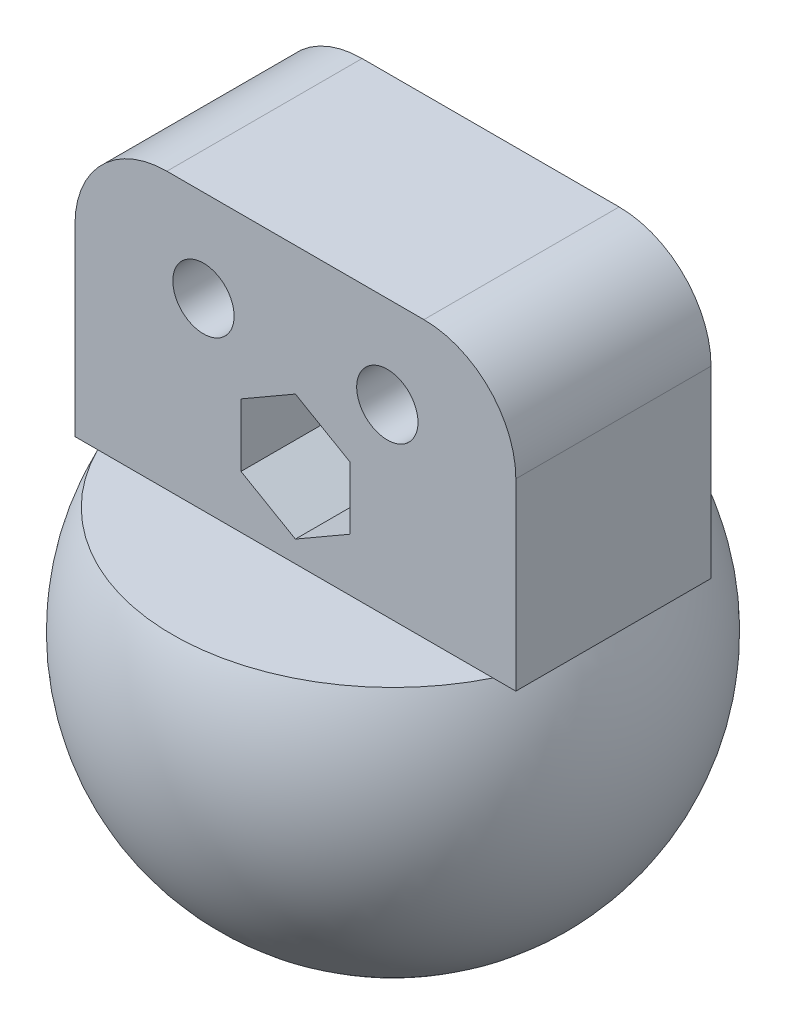
ISO-10303-21;
HEADER;
FILE_DESCRIPTION(('STEP AP214'),'2;1');
FILE_NAME('part.step','',(''),(''),'','','');
FILE_SCHEMA(('AUTOMOTIVE_DESIGN { 1 0 10303 214 1 1 1 1 }'));
ENDSEC;
DATA;
#1=APPLICATION_CONTEXT('core data for automotive mechanical design processes');
#2=APPLICATION_PROTOCOL_DEFINITION('international standard','automotive_design',2000,#1);
#3=PRODUCT_CONTEXT('',#1,'mechanical');
#4=PRODUCT('Part','Part','',(#3));
#5=PRODUCT_RELATED_PRODUCT_CATEGORY('part','',(#4));
#6=PRODUCT_DEFINITION_FORMATION('','',#4);
#7=PRODUCT_DEFINITION_CONTEXT('part definition',#1,'design');
#8=PRODUCT_DEFINITION('design','',#6,#7);
#9=PRODUCT_DEFINITION_SHAPE('','',#8);
#10=(LENGTH_UNIT() NAMED_UNIT(*) SI_UNIT(.MILLI.,.METRE.));
#11=(NAMED_UNIT(*) PLANE_ANGLE_UNIT() SI_UNIT($,.RADIAN.));
#12=(NAMED_UNIT(*) SI_UNIT($,.STERADIAN.) SOLID_ANGLE_UNIT());
#13=UNCERTAINTY_MEASURE_WITH_UNIT(LENGTH_MEASURE(1.E-05),#10,'distance_accuracy_value','');
#14=(GEOMETRIC_REPRESENTATION_CONTEXT(3) GLOBAL_UNCERTAINTY_ASSIGNED_CONTEXT((#13)) GLOBAL_UNIT_ASSIGNED_CONTEXT((#10,
#11,#12)) REPRESENTATION_CONTEXT('',''));
#15=CARTESIAN_POINT('',(0.,0.,0.));
#16=DIRECTION('',(0.,0.,1.));
#17=DIRECTION('',(1.,0.,0.));
#18=AXIS2_PLACEMENT_3D('',#15,#16,#17);
#19=CARTESIAN_POINT('',(0.,0.,0.));
#20=DIRECTION('',(0.,1.,0.));
#21=DIRECTION('',(1.,0.,0.));
#22=AXIS2_PLACEMENT_3D('',#19,#20,#21);
#23=SPHERICAL_SURFACE('',#22,16.);
#24=CARTESIAN_POINT('',(0.,7.,0.));
#25=DIRECTION('',(0.,-1.,0.));
#26=DIRECTION('',(0.,0.,-1.));
#27=AXIS2_PLACEMENT_3D('',#24,#25,#26);
#28=CIRCLE('',#27,14.3874945699382);
#29=CARTESIAN_POINT('',(-12.9005077419457,7.,6.37));
#30=VERTEX_POINT('',#29);
#31=CARTESIAN_POINT('',(-14.3874945699382,7.,0.));
#32=VERTEX_POINT('',#31);
#33=EDGE_CURVE('E352',#30,#32,#28,.T.);
#34=ORIENTED_EDGE('',*,*,#33,.T.);
#35=CARTESIAN_POINT('',(-12.9005077419457,7.,-6.37));
#36=VERTEX_POINT('',#35);
#37=EDGE_CURVE('E238',#32,#36,#28,.T.);
#38=ORIENTED_EDGE('',*,*,#37,.T.);
#39=CARTESIAN_POINT('',(0.,7.,0.));
#40=DIRECTION('',(0.,-1.,0.));
#41=DIRECTION('',(0.,0.,-1.));
#42=AXIS2_PLACEMENT_3D('',#39,#40,#41);
#43=CIRCLE('',#42,14.3874945699382);
#44=CARTESIAN_POINT('',(12.9005077419457,7.,-6.37));
#45=VERTEX_POINT('',#44);
#46=EDGE_CURVE('E271',#45,#36,#43,.F.);
#47=ORIENTED_EDGE('',*,*,#46,.F.);
#48=CARTESIAN_POINT('',(14.3874945699382,7.,0.));
#49=VERTEX_POINT('',#48);
#50=EDGE_CURVE('E237',#45,#49,#28,.T.);
#51=ORIENTED_EDGE('',*,*,#50,.T.);
#52=CARTESIAN_POINT('',(12.9005077419457,7.,6.37));
#53=VERTEX_POINT('',#52);
#54=EDGE_CURVE('E234',#49,#53,#28,.T.);
#55=ORIENTED_EDGE('',*,*,#54,.T.);
#56=CARTESIAN_POINT('',(0.,7.,0.));
#57=DIRECTION('',(0.,1.,0.));
#58=DIRECTION('',(0.,0.,1.));
#59=AXIS2_PLACEMENT_3D('',#56,#57,#58);
#60=CIRCLE('',#59,14.3874945699382);
#61=EDGE_CURVE('E266',#53,#30,#60,.F.);
#62=ORIENTED_EDGE('',*,*,#61,.T.);
#63=EDGE_LOOP('',(#34,#38,#47,#51,#55,#62));
#64=FACE_BOUND('',#63,.T.);
#65=ADVANCED_FACE('F35',(#64),#23,.T.);
#66=CARTESIAN_POINT('',(-14.3874945699382,7.,-6.37));
#67=DIRECTION('',(0.,1.,0.));
#68=DIRECTION('',(0.,0.,-1.));
#69=AXIS2_PLACEMENT_3D('',#66,#67,#68);
#70=PLANE('',#69);
#71=DIRECTION('',(1.,0.,0.));
#72=VECTOR('',#71,1.);
#73=CARTESIAN_POINT('',(-14.3874945699382,7.,-6.37));
#74=LINE('',#73,#72);
#75=CARTESIAN_POINT('',(14.3874945699382,7.,-6.37));
#76=VERTEX_POINT('',#75);
#77=EDGE_CURVE('E208',#45,#76,#74,.T.);
#78=ORIENTED_EDGE('',*,*,#77,.T.);
#79=DIRECTION('',(0.,0.,1.));
#80=VECTOR('',#79,1.);
#81=CARTESIAN_POINT('',(14.3874945699382,7.,-6.37));
#82=LINE('',#81,#80);
#83=EDGE_CURVE('E228',#76,#49,#82,.T.);
#84=ORIENTED_EDGE('',*,*,#83,.T.);
#85=ORIENTED_EDGE('',*,*,#50,.F.);
#86=EDGE_LOOP('',(#78,#84,#85));
#87=FACE_BOUND('',#86,.T.);
#88=ADVANCED_FACE('F293',(#87),#70,.F.);
#89=CARTESIAN_POINT('',(14.3874945699382,7.,6.37));
#90=VERTEX_POINT('',#89);
#91=EDGE_CURVE('E217',#49,#90,#82,.T.);
#92=ORIENTED_EDGE('',*,*,#91,.T.);
#93=DIRECTION('',(1.,0.,0.));
#94=VECTOR('',#93,1.);
#95=CARTESIAN_POINT('',(-14.3874945699382,7.,6.37));
#96=LINE('',#95,#94);
#97=EDGE_CURVE('E219',#53,#90,#96,.T.);
#98=ORIENTED_EDGE('',*,*,#97,.F.);
#99=ORIENTED_EDGE('',*,*,#54,.F.);
#100=EDGE_LOOP('',(#92,#98,#99));
#101=FACE_BOUND('',#100,.T.);
#102=ADVANCED_FACE('F299',(#101),#70,.F.);
#103=CARTESIAN_POINT('',(-14.3874945699382,7.,6.37));
#104=VERTEX_POINT('',#103);
#105=EDGE_CURVE('E220',#104,#30,#96,.T.);
#106=ORIENTED_EDGE('',*,*,#105,.F.);
#107=DIRECTION('',(0.,0.,1.));
#108=VECTOR('',#107,1.);
#109=CARTESIAN_POINT('',(-14.3874945699382,7.,-6.37));
#110=LINE('',#109,#108);
#111=EDGE_CURVE('E231',#32,#104,#110,.T.);
#112=ORIENTED_EDGE('',*,*,#111,.F.);
#113=ORIENTED_EDGE('',*,*,#33,.F.);
#114=EDGE_LOOP('',(#106,#112,#113));
#115=FACE_BOUND('',#114,.T.);
#116=ADVANCED_FACE('F289',(#115),#70,.F.);
#117=CARTESIAN_POINT('',(-3.55,14.5495934556232,-6.37));
#118=DIRECTION('',(1.,0.,0.));
#119=DIRECTION('',(0.,1.,0.));
#120=AXIS2_PLACEMENT_3D('',#117,#118,#119);
#121=PLANE('',#120);
#122=DIRECTION('',(0.,-1.,0.));
#123=VECTOR('',#122,1.);
#124=CARTESIAN_POINT('',(-3.55,14.5495934556232,-6.37));
#125=LINE('',#124,#123);
#126=CARTESIAN_POINT('',(-3.55,14.5495934556232,-6.37));
#127=VERTEX_POINT('',#126);
#128=CARTESIAN_POINT('',(-3.55,10.4504065443768,-6.37));
#129=VERTEX_POINT('',#128);
#130=EDGE_CURVE('E158',#127,#129,#125,.T.);
#131=ORIENTED_EDGE('',*,*,#130,.F.);
#132=DIRECTION('',(0.,0.,1.));
#133=VECTOR('',#132,1.);
#134=CARTESIAN_POINT('',(-3.55,14.5495934556232,-6.37));
#135=LINE('',#134,#133);
#136=CARTESIAN_POINT('',(-3.55,14.5495934556232,6.37));
#137=VERTEX_POINT('',#136);
#138=EDGE_CURVE('E188',#127,#137,#135,.T.);
#139=ORIENTED_EDGE('',*,*,#138,.T.);
#140=DIRECTION('',(0.,-1.,0.));
#141=VECTOR('',#140,1.);
#142=CARTESIAN_POINT('',(-3.55,14.5495934556232,6.37));
#143=LINE('',#142,#141);
#144=CARTESIAN_POINT('',(-3.55,10.4504065443768,6.37));
#145=VERTEX_POINT('',#144);
#146=EDGE_CURVE('E159',#137,#145,#143,.T.);
#147=ORIENTED_EDGE('',*,*,#146,.T.);
#148=DIRECTION('',(0.,0.,-1.));
#149=VECTOR('',#148,1.);
#150=CARTESIAN_POINT('',(-3.55,10.4504065443768,16.));
#151=LINE('',#150,#149);
#152=EDGE_CURVE('E145',#145,#129,#151,.T.);
#153=ORIENTED_EDGE('',*,*,#152,.T.);
#154=EDGE_LOOP('',(#131,#139,#147,#153));
#155=FACE_BOUND('',#154,.T.);
#156=ADVANCED_FACE('F156',(#155),#121,.T.);
#157=CARTESIAN_POINT('',(3.55,10.4504065443768,-6.37));
#158=DIRECTION('',(-1.,0.,0.));
#159=DIRECTION('',(0.,-1.,0.));
#160=AXIS2_PLACEMENT_3D('',#157,#158,#159);
#161=PLANE('',#160);
#162=DIRECTION('',(0.,0.,1.));
#163=VECTOR('',#162,1.);
#164=CARTESIAN_POINT('',(3.55,14.5495934556232,-6.37));
#165=LINE('',#164,#163);
#166=CARTESIAN_POINT('',(3.55,14.5495934556232,-6.37));
#167=VERTEX_POINT('',#166);
#168=CARTESIAN_POINT('',(3.55,14.5495934556232,6.37));
#169=VERTEX_POINT('',#168);
#170=EDGE_CURVE('E170',#167,#169,#165,.T.);
#171=ORIENTED_EDGE('',*,*,#170,.F.);
#172=DIRECTION('',(0.,1.,0.));
#173=VECTOR('',#172,1.);
#174=CARTESIAN_POINT('',(3.55,10.4504065443768,-6.37));
#175=LINE('',#174,#173);
#176=CARTESIAN_POINT('',(3.55,10.4504065443768,-6.37));
#177=VERTEX_POINT('',#176);
#178=EDGE_CURVE('E168',#177,#167,#175,.T.);
#179=ORIENTED_EDGE('',*,*,#178,.F.);
#180=DIRECTION('',(0.,0.,-1.));
#181=VECTOR('',#180,1.);
#182=CARTESIAN_POINT('',(3.55,10.4504065443768,16.));
#183=LINE('',#182,#181);
#184=CARTESIAN_POINT('',(3.55,10.4504065443768,6.37));
#185=VERTEX_POINT('',#184);
#186=EDGE_CURVE('E152',#185,#177,#183,.T.);
#187=ORIENTED_EDGE('',*,*,#186,.F.);
#188=DIRECTION('',(0.,1.,0.));
#189=VECTOR('',#188,1.);
#190=CARTESIAN_POINT('',(3.55,10.4504065443768,6.37));
#191=LINE('',#190,#189);
#192=EDGE_CURVE('E183',#185,#169,#191,.T.);
#193=ORIENTED_EDGE('',*,*,#192,.T.);
#194=EDGE_LOOP('',(#171,#179,#187,#193));
#195=FACE_BOUND('',#194,.T.);
#196=ADVANCED_FACE('F281',(#195),#161,.T.);
#197=CARTESIAN_POINT('',(0.,0.,-6.37));
#198=DIRECTION('',(0.,0.,-1.));
#199=DIRECTION('',(1.,0.,0.));
#200=AXIS2_PLACEMENT_3D('',#197,#198,#199);
#201=PLANE('',#200);
#202=ORIENTED_EDGE('',*,*,#178,.T.);
#203=DIRECTION('',(-0.866025403784439,0.5,0.));
#204=VECTOR('',#203,1.);
#205=CARTESIAN_POINT('',(3.55,14.5495934556232,-6.37));
#206=LINE('',#205,#204);
#207=CARTESIAN_POINT('',(0.,16.5991869112463,-6.37));
#208=VERTEX_POINT('',#207);
#209=EDGE_CURVE('E172',#167,#208,#206,.T.);
#210=ORIENTED_EDGE('',*,*,#209,.T.);
#211=DIRECTION('',(-0.866025403784438,-0.5,0.));
#212=VECTOR('',#211,1.);
#213=CARTESIAN_POINT('',(0.,16.5991869112463,-6.37));
#214=LINE('',#213,#212);
#215=EDGE_CURVE('E166',#208,#127,#214,.T.);
#216=ORIENTED_EDGE('',*,*,#215,.T.);
#217=ORIENTED_EDGE('',*,*,#130,.T.);
#218=DIRECTION('',(0.866025403784439,-0.5,0.));
#219=VECTOR('',#218,1.);
#220=CARTESIAN_POINT('',(3.63765877365274,6.30060981656524,-6.37));
#221=LINE('',#220,#219);
#222=CARTESIAN_POINT('',(0.,8.40081308875366,-6.37));
#223=VERTEX_POINT('',#222);
#224=EDGE_CURVE('E142',#129,#223,#221,.T.);
#225=ORIENTED_EDGE('',*,*,#224,.T.);
#226=DIRECTION('',(0.866025403784438,0.5,0.));
#227=VECTOR('',#226,1.);
#228=CARTESIAN_POINT('',(-3.63765877365274,6.30060981656524,-6.37));
#229=LINE('',#228,#227);
#230=EDGE_CURVE('E151',#223,#177,#229,.T.);
#231=ORIENTED_EDGE('',*,*,#230,.T.);
#232=EDGE_LOOP('',(#202,#210,#216,#217,#225,#231));
#233=FACE_BOUND('',#232,.T.);
#234=DIRECTION('',(-1.,0.,0.));
#235=VECTOR('',#234,1.);
#236=CARTESIAN_POINT('',(-14.3874945699382,25.,-6.37));
#237=LINE('',#236,#235);
#238=CARTESIAN_POINT('',(8.38749456993816,25.,-6.37));
#239=VERTEX_POINT('',#238);
#240=CARTESIAN_POINT('',(-8.38749456993816,25.,-6.37));
#241=VERTEX_POINT('',#240);
#242=EDGE_CURVE('E214',#239,#241,#237,.T.);
#243=ORIENTED_EDGE('',*,*,#242,.F.);
#244=CARTESIAN_POINT('',(8.38749456993816,19.,-6.37));
#245=DIRECTION('',(0.,0.,1.));
#246=DIRECTION('',(1.,0.,0.));
#247=AXIS2_PLACEMENT_3D('',#244,#245,#246);
#248=CIRCLE('',#247,6.);
#249=CARTESIAN_POINT('',(14.3874945699382,19.,-6.37));
#250=VERTEX_POINT('',#249);
#251=EDGE_CURVE('E250',#250,#239,#248,.T.);
#252=ORIENTED_EDGE('',*,*,#251,.F.);
#253=DIRECTION('',(0.,1.,0.));
#254=VECTOR('',#253,1.);
#255=CARTESIAN_POINT('',(14.3874945699382,25.,-6.37));
#256=LINE('',#255,#254);
#257=EDGE_CURVE('E212',#76,#250,#256,.T.);
#258=ORIENTED_EDGE('',*,*,#257,.F.);
#259=ORIENTED_EDGE('',*,*,#77,.F.);
#260=DIRECTION('',(1.,0.,0.));
#261=VECTOR('',#260,1.);
#262=CARTESIAN_POINT('',(-14.3874945699382,7.,-6.37));
#263=LINE('',#262,#261);
#264=EDGE_CURVE('E180',#36,#45,#263,.T.);
#265=ORIENTED_EDGE('',*,*,#264,.F.);
#266=CARTESIAN_POINT('',(-14.3874945699382,7.,-6.37));
#267=VERTEX_POINT('',#266);
#268=EDGE_CURVE('E210',#267,#36,#74,.T.);
#269=ORIENTED_EDGE('',*,*,#268,.F.);
#270=DIRECTION('',(0.,-1.,0.));
#271=VECTOR('',#270,1.);
#272=CARTESIAN_POINT('',(-14.3874945699382,25.,-6.37));
#273=LINE('',#272,#271);
#274=CARTESIAN_POINT('',(-14.3874945699382,19.,-6.37));
#275=VERTEX_POINT('',#274);
#276=EDGE_CURVE('E205',#275,#267,#273,.T.);
#277=ORIENTED_EDGE('',*,*,#276,.F.);
#278=CARTESIAN_POINT('',(-8.38749456993816,19.,-6.37));
#279=DIRECTION('',(0.,0.,1.));
#280=DIRECTION('',(1.,0.,0.));
#281=AXIS2_PLACEMENT_3D('',#278,#279,#280);
#282=CIRCLE('',#281,6.);
#283=EDGE_CURVE('E252',#241,#275,#282,.T.);
#284=ORIENTED_EDGE('',*,*,#283,.F.);
#285=EDGE_LOOP('',(#243,#252,#258,#259,#265,#269,#277,#284));
#286=FACE_BOUND('',#285,.T.);
#287=CARTESIAN_POINT('',(6.,19.,-6.37));
#288=DIRECTION('',(0.,0.,1.));
#289=DIRECTION('',(1.,0.,0.));
#290=AXIS2_PLACEMENT_3D('',#287,#288,#289);
#291=CIRCLE('',#290,2.);
#292=CARTESIAN_POINT('',(8.,19.,-6.37));
#293=VERTEX_POINT('',#292);
#294=EDGE_CURVE('E199',#293,#293,#291,.T.);
#295=ORIENTED_EDGE('',*,*,#294,.T.);
#296=EDGE_LOOP('',(#295));
#297=FACE_BOUND('',#296,.T.);
#298=CARTESIAN_POINT('',(-6.,19.,-6.37));
#299=DIRECTION('',(0.,0.,1.));
#300=DIRECTION('',(1.,0.,0.));
#301=AXIS2_PLACEMENT_3D('',#298,#299,#300);
#302=CIRCLE('',#301,2.);
#303=CARTESIAN_POINT('',(-4.,19.,-6.37));
#304=VERTEX_POINT('',#303);
#305=EDGE_CURVE('E193',#304,#304,#302,.T.);
#306=ORIENTED_EDGE('',*,*,#305,.T.);
#307=EDGE_LOOP('',(#306));
#308=FACE_BOUND('',#307,.T.);
#309=ADVANCED_FACE('F162',(#233,#286,#297,#308),#201,.T.);
#310=CARTESIAN_POINT('',(0.,0.,6.37));
#311=DIRECTION('',(0.,0.,-1.));
#312=DIRECTION('',(1.,0.,0.));
#313=AXIS2_PLACEMENT_3D('',#310,#311,#312);
#314=PLANE('',#313);
#315=DIRECTION('',(0.,-1.,0.));
#316=VECTOR('',#315,1.);
#317=CARTESIAN_POINT('',(-14.3874945699382,25.,6.37));
#318=LINE('',#317,#316);
#319=CARTESIAN_POINT('',(-14.3874945699382,19.,6.37));
#320=VERTEX_POINT('',#319);
#321=EDGE_CURVE('E202',#320,#104,#318,.T.);
#322=ORIENTED_EDGE('',*,*,#321,.T.);
#323=ORIENTED_EDGE('',*,*,#105,.T.);
#324=DIRECTION('',(1.,0.,0.));
#325=VECTOR('',#324,1.);
#326=CARTESIAN_POINT('',(0.,7.,6.37));
#327=LINE('',#326,#325);
#328=EDGE_CURVE('E269',#30,#53,#327,.T.);
#329=ORIENTED_EDGE('',*,*,#328,.T.);
#330=ORIENTED_EDGE('',*,*,#97,.T.);
#331=DIRECTION('',(0.,1.,0.));
#332=VECTOR('',#331,1.);
#333=CARTESIAN_POINT('',(14.3874945699382,25.,6.37));
#334=LINE('',#333,#332);
#335=CARTESIAN_POINT('',(14.3874945699382,19.,6.37));
#336=VERTEX_POINT('',#335);
#337=EDGE_CURVE('E223',#90,#336,#334,.T.);
#338=ORIENTED_EDGE('',*,*,#337,.T.);
#339=CARTESIAN_POINT('',(8.38749456993816,19.,6.37));
#340=DIRECTION('',(0.,0.,1.));
#341=DIRECTION('',(1.,0.,0.));
#342=AXIS2_PLACEMENT_3D('',#339,#340,#341);
#343=CIRCLE('',#342,6.);
#344=CARTESIAN_POINT('',(8.38749456993816,25.,6.37));
#345=VERTEX_POINT('',#344);
#346=EDGE_CURVE('E241',#345,#336,#343,.F.);
#347=ORIENTED_EDGE('',*,*,#346,.F.);
#348=DIRECTION('',(-1.,0.,0.));
#349=VECTOR('',#348,1.);
#350=CARTESIAN_POINT('',(-14.3874945699382,25.,6.37));
#351=LINE('',#350,#349);
#352=CARTESIAN_POINT('',(-8.38749456993816,25.,6.37));
#353=VERTEX_POINT('',#352);
#354=EDGE_CURVE('E209',#345,#353,#351,.T.);
#355=ORIENTED_EDGE('',*,*,#354,.T.);
#356=CARTESIAN_POINT('',(-8.38749456993816,19.,6.37));
#357=DIRECTION('',(0.,0.,1.));
#358=DIRECTION('',(1.,0.,0.));
#359=AXIS2_PLACEMENT_3D('',#356,#357,#358);
#360=CIRCLE('',#359,6.);
#361=EDGE_CURVE('E243',#320,#353,#360,.F.);
#362=ORIENTED_EDGE('',*,*,#361,.F.);
#363=EDGE_LOOP('',(#322,#323,#329,#330,#338,#347,#355,#362));
#364=FACE_BOUND('',#363,.T.);
#365=CARTESIAN_POINT('',(-6.,19.,6.37));
#366=DIRECTION('',(0.,0.,1.));
#367=DIRECTION('',(1.,0.,0.));
#368=AXIS2_PLACEMENT_3D('',#365,#366,#367);
#369=CIRCLE('',#368,2.);
#370=CARTESIAN_POINT('',(-4.,19.,6.37));
#371=VERTEX_POINT('',#370);
#372=EDGE_CURVE('E192',#371,#371,#369,.T.);
#373=ORIENTED_EDGE('',*,*,#372,.F.);
#374=EDGE_LOOP('',(#373));
#375=FACE_BOUND('',#374,.T.);
#376=CARTESIAN_POINT('',(6.,19.,6.37));
#377=DIRECTION('',(0.,0.,1.));
#378=DIRECTION('',(1.,0.,0.));
#379=AXIS2_PLACEMENT_3D('',#376,#377,#378);
#380=CIRCLE('',#379,2.);
#381=CARTESIAN_POINT('',(8.,19.,6.37));
#382=VERTEX_POINT('',#381);
#383=EDGE_CURVE('E196',#382,#382,#380,.T.);
#384=ORIENTED_EDGE('',*,*,#383,.F.);
#385=EDGE_LOOP('',(#384));
#386=FACE_BOUND('',#385,.T.);
#387=DIRECTION('',(0.866025403784438,0.5,0.));
#388=VECTOR('',#387,1.);
#389=CARTESIAN_POINT('',(-3.63765877365274,6.30060981656524,6.37));
#390=LINE('',#389,#388);
#391=CARTESIAN_POINT('',(0.,8.40081308875366,6.37));
#392=VERTEX_POINT('',#391);
#393=EDGE_CURVE('E11',#392,#185,#390,.T.);
#394=ORIENTED_EDGE('',*,*,#393,.F.);
#395=DIRECTION('',(0.866025403784439,-0.5,0.));
#396=VECTOR('',#395,1.);
#397=CARTESIAN_POINT('',(3.63765877365274,6.30060981656524,6.37));
#398=LINE('',#397,#396);
#399=EDGE_CURVE('E43',#145,#392,#398,.T.);
#400=ORIENTED_EDGE('',*,*,#399,.F.);
#401=ORIENTED_EDGE('',*,*,#146,.F.);
#402=DIRECTION('',(-0.866025403784438,-0.5,0.));
#403=VECTOR('',#402,1.);
#404=CARTESIAN_POINT('',(0.,16.5991869112463,6.37));
#405=LINE('',#404,#403);
#406=CARTESIAN_POINT('',(0.,16.5991869112463,6.37));
#407=VERTEX_POINT('',#406);
#408=EDGE_CURVE('E179',#407,#137,#405,.T.);
#409=ORIENTED_EDGE('',*,*,#408,.F.);
#410=DIRECTION('',(-0.866025403784439,0.5,0.));
#411=VECTOR('',#410,1.);
#412=CARTESIAN_POINT('',(3.55,14.5495934556232,6.37));
#413=LINE('',#412,#411);
#414=EDGE_CURVE('E176',#169,#407,#413,.T.);
#415=ORIENTED_EDGE('',*,*,#414,.F.);
#416=ORIENTED_EDGE('',*,*,#192,.F.);
#417=EDGE_LOOP('',(#394,#400,#401,#409,#415,#416));
#418=FACE_BOUND('',#417,.T.);
#419=ADVANCED_FACE('F256',(#364,#375,#386,#418),#314,.F.);
#420=CARTESIAN_POINT('',(-14.3874945699382,25.,-6.37));
#421=DIRECTION('',(1.,0.,0.));
#422=DIRECTION('',(0.,1.,0.));
#423=AXIS2_PLACEMENT_3D('',#420,#421,#422);
#424=PLANE('',#423);
#425=ORIENTED_EDGE('',*,*,#276,.T.);
#426=EDGE_CURVE('E232',#267,#32,#110,.T.);
#427=ORIENTED_EDGE('',*,*,#426,.T.);
#428=ORIENTED_EDGE('',*,*,#111,.T.);
#429=ORIENTED_EDGE('',*,*,#321,.F.);
#430=DIRECTION('',(0.,0.,1.));
#431=VECTOR('',#430,1.);
#432=CARTESIAN_POINT('',(-14.3874945699382,19.,-6.37));
#433=LINE('',#432,#431);
#434=EDGE_CURVE('E239',#275,#320,#433,.T.);
#435=ORIENTED_EDGE('',*,*,#434,.F.);
#436=EDGE_LOOP('',(#425,#427,#428,#429,#435));
#437=FACE_BOUND('',#436,.T.);
#438=ADVANCED_FACE('F305',(#437),#424,.F.);
#439=ORIENTED_EDGE('',*,*,#426,.F.);
#440=ORIENTED_EDGE('',*,*,#268,.T.);
#441=ORIENTED_EDGE('',*,*,#37,.F.);
#442=EDGE_LOOP('',(#439,#440,#441));
#443=FACE_BOUND('',#442,.T.);
#444=ADVANCED_FACE('F302',(#443),#70,.F.);
#445=CARTESIAN_POINT('',(14.3874945699382,25.,-6.37));
#446=DIRECTION('',(-1.,0.,0.));
#447=DIRECTION('',(0.,-1.,0.));
#448=AXIS2_PLACEMENT_3D('',#445,#446,#447);
#449=PLANE('',#448);
#450=ORIENTED_EDGE('',*,*,#337,.F.);
#451=ORIENTED_EDGE('',*,*,#91,.F.);
#452=ORIENTED_EDGE('',*,*,#83,.F.);
#453=ORIENTED_EDGE('',*,*,#257,.T.);
#454=DIRECTION('',(0.,0.,1.));
#455=VECTOR('',#454,1.);
#456=CARTESIAN_POINT('',(14.3874945699382,19.,-6.37));
#457=LINE('',#456,#455);
#458=EDGE_CURVE('E57',#336,#250,#457,.F.);
#459=ORIENTED_EDGE('',*,*,#458,.F.);
#460=EDGE_LOOP('',(#450,#451,#452,#453,#459));
#461=FACE_BOUND('',#460,.T.);
#462=ADVANCED_FACE('F342',(#461),#449,.F.);
#463=CARTESIAN_POINT('',(-14.3874945699382,25.,-6.37));
#464=DIRECTION('',(0.,-1.,0.));
#465=DIRECTION('',(0.,0.,1.));
#466=AXIS2_PLACEMENT_3D('',#463,#464,#465);
#467=PLANE('',#466);
#468=ORIENTED_EDGE('',*,*,#354,.F.);
#469=DIRECTION('',(0.,0.,1.));
#470=VECTOR('',#469,1.);
#471=CARTESIAN_POINT('',(8.38749456993816,25.,-6.37));
#472=LINE('',#471,#470);
#473=EDGE_CURVE('E246',#239,#345,#472,.T.);
#474=ORIENTED_EDGE('',*,*,#473,.F.);
#475=ORIENTED_EDGE('',*,*,#242,.T.);
#476=DIRECTION('',(0.,0.,1.));
#477=VECTOR('',#476,1.);
#478=CARTESIAN_POINT('',(-8.38749456993816,25.,-6.37));
#479=LINE('',#478,#477);
#480=EDGE_CURVE('E248',#353,#241,#479,.F.);
#481=ORIENTED_EDGE('',*,*,#480,.F.);
#482=EDGE_LOOP('',(#468,#474,#475,#481));
#483=FACE_BOUND('',#482,.T.);
#484=ADVANCED_FACE('F334',(#483),#467,.F.);
#485=CARTESIAN_POINT('',(6.,19.,-6.37));
#486=DIRECTION('',(0.,0.,1.));
#487=DIRECTION('',(-1.,0.,0.));
#488=AXIS2_PLACEMENT_3D('',#485,#486,#487);
#489=CYLINDRICAL_SURFACE('',#488,2.);
#490=ORIENTED_EDGE('',*,*,#294,.F.);
#491=EDGE_LOOP('',(#490));
#492=FACE_BOUND('',#491,.T.);
#493=ORIENTED_EDGE('',*,*,#383,.T.);
#494=EDGE_LOOP('',(#493));
#495=FACE_BOUND('',#494,.T.);
#496=ADVANCED_FACE('F367',(#492,#495),#489,.F.);
#497=CARTESIAN_POINT('',(-6.,19.,-6.37));
#498=DIRECTION('',(0.,0.,1.));
#499=DIRECTION('',(-1.,0.,0.));
#500=AXIS2_PLACEMENT_3D('',#497,#498,#499);
#501=CYLINDRICAL_SURFACE('',#500,2.);
#502=ORIENTED_EDGE('',*,*,#305,.F.);
#503=EDGE_LOOP('',(#502));
#504=FACE_BOUND('',#503,.T.);
#505=ORIENTED_EDGE('',*,*,#372,.T.);
#506=EDGE_LOOP('',(#505));
#507=FACE_BOUND('',#506,.T.);
#508=ADVANCED_FACE('F372',(#504,#507),#501,.F.);
#509=CARTESIAN_POINT('',(3.55,14.5495934556232,-6.37));
#510=DIRECTION('',(-0.5,-0.866025403784439,0.));
#511=DIRECTION('',(0.866025403784439,-0.5,0.));
#512=AXIS2_PLACEMENT_3D('',#509,#510,#511);
#513=PLANE('',#512);
#514=ORIENTED_EDGE('',*,*,#414,.T.);
#515=DIRECTION('',(0.,0.,1.));
#516=VECTOR('',#515,1.);
#517=CARTESIAN_POINT('',(0.,16.5991869112463,-6.37));
#518=LINE('',#517,#516);
#519=EDGE_CURVE('E190',#208,#407,#518,.T.);
#520=ORIENTED_EDGE('',*,*,#519,.F.);
#521=ORIENTED_EDGE('',*,*,#209,.F.);
#522=ORIENTED_EDGE('',*,*,#170,.T.);
#523=EDGE_LOOP('',(#514,#520,#521,#522));
#524=FACE_BOUND('',#523,.T.);
#525=ADVANCED_FACE('F276',(#524),#513,.T.);
#526=CARTESIAN_POINT('',(0.,16.5991869112463,-6.37));
#527=DIRECTION('',(0.5,-0.866025403784438,0.));
#528=DIRECTION('',(0.866025403784439,0.5,0.));
#529=AXIS2_PLACEMENT_3D('',#526,#527,#528);
#530=PLANE('',#529);
#531=ORIENTED_EDGE('',*,*,#215,.F.);
#532=ORIENTED_EDGE('',*,*,#519,.T.);
#533=ORIENTED_EDGE('',*,*,#408,.T.);
#534=ORIENTED_EDGE('',*,*,#138,.F.);
#535=EDGE_LOOP('',(#531,#532,#533,#534));
#536=FACE_BOUND('',#535,.T.);
#537=ADVANCED_FACE('F279',(#536),#530,.T.);
#538=CARTESIAN_POINT('',(-14.3874945699382,7.,-16.001));
#539=DIRECTION('',(0.,1.,0.));
#540=DIRECTION('',(0.,0.,-1.));
#541=AXIS2_PLACEMENT_3D('',#538,#539,#540);
#542=PLANE('',#541);
#543=ORIENTED_EDGE('',*,*,#264,.T.);
#544=ORIENTED_EDGE('',*,*,#46,.T.);
#545=EDGE_LOOP('',(#543,#544));
#546=FACE_BOUND('',#545,.T.);
#547=ADVANCED_FACE('F314',(#546),#542,.T.);
#548=CARTESIAN_POINT('',(0.,7.,16.001));
#549=DIRECTION('',(0.,-1.,0.));
#550=DIRECTION('',(0.,0.,1.));
#551=AXIS2_PLACEMENT_3D('',#548,#549,#550);
#552=PLANE('',#551);
#553=ORIENTED_EDGE('',*,*,#61,.F.);
#554=ORIENTED_EDGE('',*,*,#328,.F.);
#555=EDGE_LOOP('',(#553,#554));
#556=FACE_BOUND('',#555,.T.);
#557=ADVANCED_FACE('F308',(#556),#552,.F.);
#558=CARTESIAN_POINT('',(-8.38749456993816,19.,-6.37));
#559=DIRECTION('',(0.,0.,1.));
#560=DIRECTION('',(-1.,0.,0.));
#561=AXIS2_PLACEMENT_3D('',#558,#559,#560);
#562=CYLINDRICAL_SURFACE('',#561,6.);
#563=ORIENTED_EDGE('',*,*,#283,.T.);
#564=ORIENTED_EDGE('',*,*,#434,.T.);
#565=ORIENTED_EDGE('',*,*,#361,.T.);
#566=ORIENTED_EDGE('',*,*,#480,.T.);
#567=EDGE_LOOP('',(#563,#564,#565,#566));
#568=FACE_BOUND('',#567,.T.);
#569=ADVANCED_FACE('F306',(#568),#562,.T.);
#570=CARTESIAN_POINT('',(8.38749456993816,19.,-6.37));
#571=DIRECTION('',(0.,0.,1.));
#572=DIRECTION('',(-1.,0.,0.));
#573=AXIS2_PLACEMENT_3D('',#570,#571,#572);
#574=CYLINDRICAL_SURFACE('',#573,6.);
#575=ORIENTED_EDGE('',*,*,#251,.T.);
#576=ORIENTED_EDGE('',*,*,#473,.T.);
#577=ORIENTED_EDGE('',*,*,#346,.T.);
#578=ORIENTED_EDGE('',*,*,#458,.T.);
#579=EDGE_LOOP('',(#575,#576,#577,#578));
#580=FACE_BOUND('',#579,.T.);
#581=ADVANCED_FACE('F37',(#580),#574,.T.);
#582=CARTESIAN_POINT('',(0.,8.40081308875366,16.));
#583=DIRECTION('',(0.5,-0.866025403784438,0.));
#584=DIRECTION('',(0.866025403784438,0.5,0.));
#585=AXIS2_PLACEMENT_3D('',#582,#583,#584);
#586=PLANE('',#585);
#587=ORIENTED_EDGE('',*,*,#230,.F.);
#588=DIRECTION('',(0.,0.,-1.));
#589=VECTOR('',#588,1.);
#590=CARTESIAN_POINT('',(0.,8.40081308875366,16.));
#591=LINE('',#590,#589);
#592=EDGE_CURVE('E147',#392,#223,#591,.T.);
#593=ORIENTED_EDGE('',*,*,#592,.F.);
#594=ORIENTED_EDGE('',*,*,#393,.T.);
#595=ORIENTED_EDGE('',*,*,#186,.T.);
#596=EDGE_LOOP('',(#587,#593,#594,#595));
#597=FACE_BOUND('',#596,.T.);
#598=ADVANCED_FACE('F260',(#597),#586,.F.);
#599=CARTESIAN_POINT('',(-3.55,10.4504065443768,16.));
#600=DIRECTION('',(-0.5,-0.866025403784439,0.));
#601=DIRECTION('',(0.866025403784439,-0.5,0.));
#602=AXIS2_PLACEMENT_3D('',#599,#600,#601);
#603=PLANE('',#602);
#604=ORIENTED_EDGE('',*,*,#224,.F.);
#605=ORIENTED_EDGE('',*,*,#152,.F.);
#606=ORIENTED_EDGE('',*,*,#399,.T.);
#607=ORIENTED_EDGE('',*,*,#592,.T.);
#608=EDGE_LOOP('',(#604,#605,#606,#607));
#609=FACE_BOUND('',#608,.T.);
#610=ADVANCED_FACE('F144',(#609),#603,.F.);
#611=CLOSED_SHELL('',(#65,#88,#102,#116,#156,#196,#309,#419,#438,#444,#462,#484,#496,#508,#525,
#537,#547,#557,#569,#581,#598,#610));
#612=MANIFOLD_SOLID_BREP('B2',#611);
#613=ADVANCED_BREP_SHAPE_REPRESENTATION('',(#18,#612),#14);
#614=SHAPE_DEFINITION_REPRESENTATION(#9,#613);
ENDSEC;
END-ISO-10303-21;
